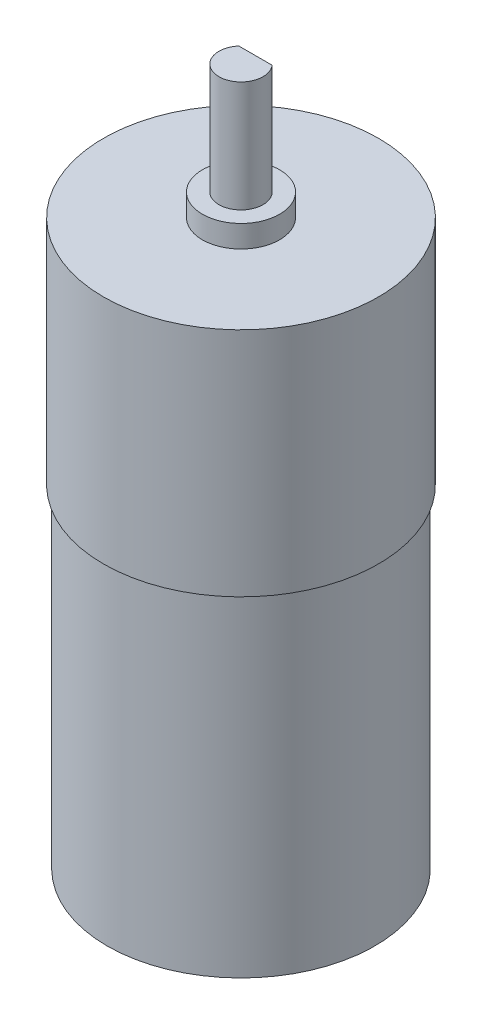
ISO-10303-21;
HEADER;
FILE_DESCRIPTION(('STEP AP214'),'2;1');
FILE_NAME('part.step','',(''),(''),'','','');
FILE_SCHEMA(('AUTOMOTIVE_DESIGN { 1 0 10303 214 1 1 1 1 }'));
ENDSEC;
DATA;
#1=APPLICATION_CONTEXT('core data for automotive mechanical design processes');
#2=APPLICATION_PROTOCOL_DEFINITION('international standard','automotive_design',2000,#1);
#3=PRODUCT_CONTEXT('',#1,'mechanical');
#4=PRODUCT('Part','Part','',(#3));
#5=PRODUCT_RELATED_PRODUCT_CATEGORY('part','',(#4));
#6=PRODUCT_DEFINITION_FORMATION('','',#4);
#7=PRODUCT_DEFINITION_CONTEXT('part definition',#1,'design');
#8=PRODUCT_DEFINITION('design','',#6,#7);
#9=PRODUCT_DEFINITION_SHAPE('','',#8);
#10=(LENGTH_UNIT() NAMED_UNIT(*) SI_UNIT(.MILLI.,.METRE.));
#11=(NAMED_UNIT(*) PLANE_ANGLE_UNIT() SI_UNIT($,.RADIAN.));
#12=(NAMED_UNIT(*) SI_UNIT($,.STERADIAN.) SOLID_ANGLE_UNIT());
#13=UNCERTAINTY_MEASURE_WITH_UNIT(LENGTH_MEASURE(1.E-05),#10,'distance_accuracy_value','');
#14=(GEOMETRIC_REPRESENTATION_CONTEXT(3) GLOBAL_UNCERTAINTY_ASSIGNED_CONTEXT((#13)) GLOBAL_UNIT_ASSIGNED_CONTEXT((#10,
#11,#12)) REPRESENTATION_CONTEXT('',''));
#15=CARTESIAN_POINT('',(0.,0.,0.));
#16=DIRECTION('',(0.,0.,1.));
#17=DIRECTION('',(1.,0.,0.));
#18=AXIS2_PLACEMENT_3D('',#15,#16,#17);
#19=CARTESIAN_POINT('',(0.,21.0004958677686,0.));
#20=DIRECTION('',(0.,1.,0.));
#21=DIRECTION('',(0.,0.,1.));
#22=AXIS2_PLACEMENT_3D('',#19,#20,#21);
#23=PLANE('',#22);
#24=CARTESIAN_POINT('',(0.,21.0004958677686,0.));
#25=DIRECTION('',(0.,1.,0.));
#26=DIRECTION('',(0.,0.,1.));
#27=AXIS2_PLACEMENT_3D('',#24,#25,#26);
#28=CIRCLE('',#27,3.48);
#29=CARTESIAN_POINT('',(0.,21.0004958677686,3.48000000000001));
#30=VERTEX_POINT('',#29);
#31=EDGE_CURVE('E81',#30,#30,#28,.T.);
#32=ORIENTED_EDGE('',*,*,#31,.T.);
#33=EDGE_LOOP('',(#32));
#34=FACE_BOUND('',#33,.T.);
#35=DIRECTION('',(-1.,0.,0.));
#36=VECTOR('',#35,1.);
#37=CARTESIAN_POINT('',(-1.5,21.0004958677686,-1.30556037288629));
#38=LINE('',#37,#36);
#39=CARTESIAN_POINT('',(1.5,21.0004958677686,-1.30556037288629));
#40=VERTEX_POINT('',#39);
#41=CARTESIAN_POINT('',(-1.5,21.0004958677686,-1.30556037288629));
#42=VERTEX_POINT('',#41);
#43=EDGE_CURVE('E65',#40,#42,#38,.T.);
#44=ORIENTED_EDGE('',*,*,#43,.F.);
#45=CARTESIAN_POINT('',(0.,21.0004958677686,0.));
#46=DIRECTION('',(0.,1.,0.));
#47=DIRECTION('',(0.,0.,1.));
#48=AXIS2_PLACEMENT_3D('',#45,#46,#47);
#49=CIRCLE('',#48,1.98858942148726);
#50=EDGE_CURVE('E50',#42,#40,#49,.T.);
#51=ORIENTED_EDGE('',*,*,#50,.F.);
#52=EDGE_LOOP('',(#44,#51));
#53=FACE_BOUND('',#52,.T.);
#54=ADVANCED_FACE('F35',(#34,#53),#23,.T.);
#55=CARTESIAN_POINT('',(0.,44.2561983471074,0.));
#56=DIRECTION('',(0.,1.,0.));
#57=DIRECTION('',(0.,0.,1.));
#58=AXIS2_PLACEMENT_3D('',#55,#56,#57);
#59=CYLINDRICAL_SURFACE('',#58,12.075);
#60=CARTESIAN_POINT('',(0.,-1.85950413223139,0.));
#61=DIRECTION('',(0.,1.,0.));
#62=DIRECTION('',(0.,0.,1.));
#63=AXIS2_PLACEMENT_3D('',#60,#61,#62);
#64=CIRCLE('',#63,12.075);
#65=CARTESIAN_POINT('',(0.,-1.85950413223139,12.075));
#66=VERTEX_POINT('',#65);
#67=EDGE_CURVE('E11',#66,#66,#64,.T.);
#68=ORIENTED_EDGE('',*,*,#67,.F.);
#69=EDGE_LOOP('',(#68));
#70=FACE_BOUND('',#69,.T.);
#71=CARTESIAN_POINT('',(0.,-31.8595041322314,0.));
#72=DIRECTION('',(0.,1.,0.));
#73=DIRECTION('',(0.,0.,1.));
#74=AXIS2_PLACEMENT_3D('',#71,#72,#73);
#75=CIRCLE('',#74,12.075);
#76=CARTESIAN_POINT('',(0.,-31.8595041322314,12.075));
#77=VERTEX_POINT('',#76);
#78=EDGE_CURVE('E43',#77,#77,#75,.T.);
#79=ORIENTED_EDGE('',*,*,#78,.T.);
#80=EDGE_LOOP('',(#79));
#81=FACE_BOUND('',#80,.T.);
#82=ADVANCED_FACE('F37',(#70,#81),#59,.T.);
#83=CARTESIAN_POINT('',(0.,-31.8595041322314,0.));
#84=DIRECTION('',(0.,1.,0.));
#85=DIRECTION('',(0.,0.,1.));
#86=AXIS2_PLACEMENT_3D('',#83,#84,#85);
#87=PLANE('',#86);
#88=ORIENTED_EDGE('',*,*,#78,.F.);
#89=EDGE_LOOP('',(#88));
#90=FACE_BOUND('',#89,.T.);
#91=ADVANCED_FACE('F95',(#90),#87,.F.);
#92=CARTESIAN_POINT('',(0.,19.0004958677686,0.));
#93=DIRECTION('',(0.,1.,0.));
#94=DIRECTION('',(0.,0.,1.));
#95=AXIS2_PLACEMENT_3D('',#92,#93,#94);
#96=PLANE('',#95);
#97=CARTESIAN_POINT('',(0.,19.0004958677686,0.));
#98=DIRECTION('',(0.,1.,0.));
#99=DIRECTION('',(0.,0.,1.));
#100=AXIS2_PLACEMENT_3D('',#97,#98,#99);
#101=CIRCLE('',#100,3.48);
#102=CARTESIAN_POINT('',(0.,19.0004958677686,3.48000000000001));
#103=VERTEX_POINT('',#102);
#104=EDGE_CURVE('E80',#103,#103,#101,.T.);
#105=ORIENTED_EDGE('',*,*,#104,.F.);
#106=EDGE_LOOP('',(#105));
#107=FACE_BOUND('',#106,.T.);
#108=CARTESIAN_POINT('',(0.,19.0004958677686,0.));
#109=DIRECTION('',(0.,-1.,0.));
#110=DIRECTION('',(0.,0.,-1.));
#111=AXIS2_PLACEMENT_3D('',#108,#109,#110);
#112=CIRCLE('',#111,12.4);
#113=CARTESIAN_POINT('',(0.,19.0004958677686,-12.4));
#114=VERTEX_POINT('',#113);
#115=EDGE_CURVE('E89',#114,#114,#112,.T.);
#116=ORIENTED_EDGE('',*,*,#115,.F.);
#117=EDGE_LOOP('',(#116));
#118=FACE_BOUND('',#117,.T.);
#119=ADVANCED_FACE('F97',(#107,#118),#96,.T.);
#120=CARTESIAN_POINT('',(0.,-1.85950413223139,0.));
#121=DIRECTION('',(0.,-1.,0.));
#122=DIRECTION('',(0.,0.,-1.));
#123=AXIS2_PLACEMENT_3D('',#120,#121,#122);
#124=CYLINDRICAL_SURFACE('',#123,12.4);
#125=ORIENTED_EDGE('',*,*,#115,.T.);
#126=EDGE_LOOP('',(#125));
#127=FACE_BOUND('',#126,.T.);
#128=CARTESIAN_POINT('',(0.,-1.8595041322314,0.));
#129=DIRECTION('',(0.,-1.,0.));
#130=DIRECTION('',(0.,0.,-1.));
#131=AXIS2_PLACEMENT_3D('',#128,#129,#130);
#132=CIRCLE('',#131,12.4);
#133=CARTESIAN_POINT('',(0.,-1.85950413223139,-12.4));
#134=VERTEX_POINT('',#133);
#135=EDGE_CURVE('E84',#134,#134,#132,.T.);
#136=ORIENTED_EDGE('',*,*,#135,.F.);
#137=EDGE_LOOP('',(#136));
#138=FACE_BOUND('',#137,.T.);
#139=ADVANCED_FACE('F102',(#127,#138),#124,.T.);
#140=CARTESIAN_POINT('',(0.,-1.85950413223139,0.));
#141=DIRECTION('',(0.,-1.,0.));
#142=DIRECTION('',(0.,0.,-1.));
#143=AXIS2_PLACEMENT_3D('',#140,#141,#142);
#144=PLANE('',#143);
#145=ORIENTED_EDGE('',*,*,#67,.T.);
#146=EDGE_LOOP('',(#145));
#147=FACE_BOUND('',#146,.T.);
#148=ORIENTED_EDGE('',*,*,#135,.T.);
#149=EDGE_LOOP('',(#148));
#150=FACE_BOUND('',#149,.T.);
#151=ADVANCED_FACE('F117',(#147,#150),#144,.T.);
#152=CARTESIAN_POINT('',(0.,21.0004958677686,0.));
#153=DIRECTION('',(0.,-1.,0.));
#154=DIRECTION('',(0.,0.,-1.));
#155=AXIS2_PLACEMENT_3D('',#152,#153,#154);
#156=CYLINDRICAL_SURFACE('',#155,3.48);
#157=ORIENTED_EDGE('',*,*,#31,.F.);
#158=EDGE_LOOP('',(#157));
#159=FACE_BOUND('',#158,.T.);
#160=ORIENTED_EDGE('',*,*,#104,.T.);
#161=EDGE_LOOP('',(#160));
#162=FACE_BOUND('',#161,.T.);
#163=ADVANCED_FACE('F114',(#159,#162),#156,.T.);
#164=CARTESIAN_POINT('',(0.,31.0004958677686,0.));
#165=DIRECTION('',(0.,-1.,0.));
#166=DIRECTION('',(0.,0.,-1.));
#167=AXIS2_PLACEMENT_3D('',#164,#165,#166);
#168=CYLINDRICAL_SURFACE('',#167,1.98858942148726);
#169=ORIENTED_EDGE('',*,*,#50,.T.);
#170=DIRECTION('',(0.,-1.,0.));
#171=VECTOR('',#170,1.);
#172=CARTESIAN_POINT('',(1.5,31.0004958677686,-1.30556037288628));
#173=LINE('',#172,#171);
#174=CARTESIAN_POINT('',(1.5,31.0004958677686,-1.30556037288628));
#175=VERTEX_POINT('',#174);
#176=EDGE_CURVE('E69',#175,#40,#173,.T.);
#177=ORIENTED_EDGE('',*,*,#176,.F.);
#178=CARTESIAN_POINT('',(0.,31.0004958677686,0.));
#179=DIRECTION('',(0.,1.,0.));
#180=DIRECTION('',(0.,0.,1.));
#181=AXIS2_PLACEMENT_3D('',#178,#179,#180);
#182=CIRCLE('',#181,1.98858942148726);
#183=CARTESIAN_POINT('',(-1.5,31.0004958677686,-1.30556037288628));
#184=VERTEX_POINT('',#183);
#185=EDGE_CURVE('E71',#184,#175,#182,.T.);
#186=ORIENTED_EDGE('',*,*,#185,.F.);
#187=DIRECTION('',(0.,-1.,0.));
#188=VECTOR('',#187,1.);
#189=CARTESIAN_POINT('',(-1.5,31.0004958677686,-1.30556037288628));
#190=LINE('',#189,#188);
#191=EDGE_CURVE('E67',#184,#42,#190,.T.);
#192=ORIENTED_EDGE('',*,*,#191,.T.);
#193=EDGE_LOOP('',(#169,#177,#186,#192));
#194=FACE_BOUND('',#193,.T.);
#195=ADVANCED_FACE('F73',(#194),#168,.T.);
#196=CARTESIAN_POINT('',(-1.5,31.0004958677686,-1.30556037288628));
#197=DIRECTION('',(0.,0.,1.));
#198=DIRECTION('',(0.,-1.,0.));
#199=AXIS2_PLACEMENT_3D('',#196,#197,#198);
#200=PLANE('',#199);
#201=ORIENTED_EDGE('',*,*,#43,.T.);
#202=ORIENTED_EDGE('',*,*,#191,.F.);
#203=DIRECTION('',(-1.,0.,0.));
#204=VECTOR('',#203,1.);
#205=CARTESIAN_POINT('',(-1.5,31.0004958677686,-1.30556037288628));
#206=LINE('',#205,#204);
#207=EDGE_CURVE('E58',#175,#184,#206,.T.);
#208=ORIENTED_EDGE('',*,*,#207,.F.);
#209=ORIENTED_EDGE('',*,*,#176,.T.);
#210=EDGE_LOOP('',(#201,#202,#208,#209));
#211=FACE_BOUND('',#210,.T.);
#212=ADVANCED_FACE('F66',(#211),#200,.F.);
#213=CARTESIAN_POINT('',(0.,31.0004958677686,0.));
#214=DIRECTION('',(0.,1.,0.));
#215=DIRECTION('',(0.,0.,1.));
#216=AXIS2_PLACEMENT_3D('',#213,#214,#215);
#217=PLANE('',#216);
#218=ORIENTED_EDGE('',*,*,#185,.T.);
#219=ORIENTED_EDGE('',*,*,#207,.T.);
#220=EDGE_LOOP('',(#218,#219));
#221=FACE_BOUND('',#220,.T.);
#222=ADVANCED_FACE('F152',(#221),#217,.T.);
#223=CLOSED_SHELL('',(#54,#82,#91,#119,#139,#151,#163,#195,#212,#222));
#224=MANIFOLD_SOLID_BREP('B2',#223);
#225=ADVANCED_BREP_SHAPE_REPRESENTATION('',(#18,#224),#14);
#226=SHAPE_DEFINITION_REPRESENTATION(#9,#225);
ENDSEC;
END-ISO-10303-21;
